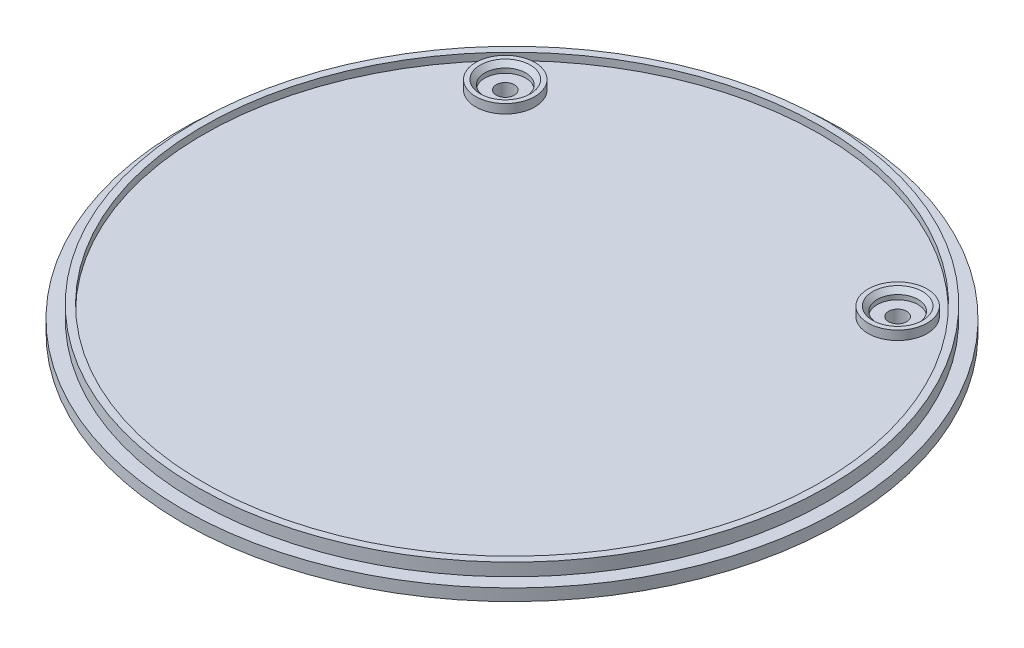
ISO-10303-21;
HEADER;
FILE_DESCRIPTION(('STEP AP214'),'2;1');
FILE_NAME('part.step','',(''),(''),'','','');
FILE_SCHEMA(('AUTOMOTIVE_DESIGN { 1 0 10303 214 1 1 1 1 }'));
ENDSEC;
DATA;
#1=APPLICATION_CONTEXT('core data for automotive mechanical design processes');
#2=APPLICATION_PROTOCOL_DEFINITION('international standard','automotive_design',2000,#1);
#3=PRODUCT_CONTEXT('',#1,'mechanical');
#4=PRODUCT('Part','Part','',(#3));
#5=PRODUCT_RELATED_PRODUCT_CATEGORY('part','',(#4));
#6=PRODUCT_DEFINITION_FORMATION('','',#4);
#7=PRODUCT_DEFINITION_CONTEXT('part definition',#1,'design');
#8=PRODUCT_DEFINITION('design','',#6,#7);
#9=PRODUCT_DEFINITION_SHAPE('','',#8);
#10=(LENGTH_UNIT() NAMED_UNIT(*) SI_UNIT(.MILLI.,.METRE.));
#11=(NAMED_UNIT(*) PLANE_ANGLE_UNIT() SI_UNIT($,.RADIAN.));
#12=(NAMED_UNIT(*) SI_UNIT($,.STERADIAN.) SOLID_ANGLE_UNIT());
#13=UNCERTAINTY_MEASURE_WITH_UNIT(LENGTH_MEASURE(1.E-05),#10,'distance_accuracy_value','');
#14=(GEOMETRIC_REPRESENTATION_CONTEXT(3) GLOBAL_UNCERTAINTY_ASSIGNED_CONTEXT((#13)) GLOBAL_UNIT_ASSIGNED_CONTEXT((#10,
#11,#12)) REPRESENTATION_CONTEXT('',''));
#15=CARTESIAN_POINT('',(0.,0.,0.));
#16=DIRECTION('',(0.,0.,1.));
#17=DIRECTION('',(1.,0.,0.));
#18=AXIS2_PLACEMENT_3D('',#15,#16,#17);
#19=CARTESIAN_POINT('',(0.,0.,0.));
#20=DIRECTION('',(0.,1.,0.));
#21=DIRECTION('',(0.,0.,1.));
#22=AXIS2_PLACEMENT_3D('',#19,#20,#21);
#23=PLANE('',#22);
#24=CARTESIAN_POINT('',(0.,0.,0.));
#25=DIRECTION('',(0.,1.,0.));
#26=DIRECTION('',(0.,0.,1.));
#27=AXIS2_PLACEMENT_3D('',#24,#25,#26);
#28=CIRCLE('',#27,16.5);
#29=CARTESIAN_POINT('',(0.,0.,16.5));
#30=VERTEX_POINT('',#29);
#31=EDGE_CURVE('E128',#30,#30,#28,.T.);
#32=ORIENTED_EDGE('',*,*,#31,.F.);
#33=EDGE_LOOP('',(#32));
#34=FACE_BOUND('',#33,.T.);
#35=ADVANCED_FACE('F16',(#34),#23,.F.);
#36=CARTESIAN_POINT('',(0.,-0.5,0.));
#37=DIRECTION('',(0.,1.,0.));
#38=DIRECTION('',(0.,0.,1.));
#39=AXIS2_PLACEMENT_3D('',#36,#37,#38);
#40=CYLINDRICAL_SURFACE('',#39,16.5);
#41=CARTESIAN_POINT('',(0.,-0.499999999999945,0.));
#42=DIRECTION('',(0.,-1.,0.));
#43=DIRECTION('',(0.,0.,-1.));
#44=AXIS2_PLACEMENT_3D('',#41,#42,#43);
#45=CIRCLE('',#44,16.5);
#46=CARTESIAN_POINT('',(0.,-0.5,-16.5));
#47=VERTEX_POINT('',#46);
#48=EDGE_CURVE('E69',#47,#47,#45,.F.);
#49=ORIENTED_EDGE('',*,*,#48,.F.);
#50=EDGE_LOOP('',(#49));
#51=FACE_BOUND('',#50,.T.);
#52=ORIENTED_EDGE('',*,*,#31,.T.);
#53=EDGE_LOOP('',(#52));
#54=FACE_BOUND('',#53,.T.);
#55=ADVANCED_FACE('F113',(#51,#54),#40,.F.);
#56=CARTESIAN_POINT('',(-2.62510043724167E-10,-0.232455532033882,-34.2582976911812));
#57=CARTESIAN_POINT('',(-2.62510035058757E-10,-0.34207403417429,-34.3998145689233));
#58=CARTESIAN_POINT('',(-2.62510024687541E-10,-0.40000000008312,-34.5691893757008));
#59=CARTESIAN_POINT('',(-2.62510013726569E-10,-0.399999999999999,-34.748195640109));
#60=(BOUNDED_CURVE() B_SPLINE_CURVE(3,(#56,#57,#58,#59),.UNSPECIFIED.,.F.,
.F.) B_SPLINE_CURVE_WITH_KNOTS((4,4),(0.,1.),
.UNSPECIFIED.) CURVE() GEOMETRIC_REPRESENTATION_ITEM() RATIONAL_B_SPLINE_CURVE((1.,
0.964129904654601,0.964129904654601,1.)) REPRESENTATION_ITEM(''));
#61=CARTESIAN_POINT('',(0.,0.4,0.));
#62=DIRECTION('',(0.,-1.,0.));
#63=AXIS1_PLACEMENT('',#61,#62);
#64=SURFACE_OF_REVOLUTION('',#60,#63);
#65=CARTESIAN_POINT('',(0.,-0.232455532012787,0.));
#66=DIRECTION('',(0.,-1.,0.));
#67=DIRECTION('',(0.,0.,-1.));
#68=AXIS2_PLACEMENT_3D('',#65,#66,#67);
#69=CIRCLE('',#68,34.2582976910164);
#70=CARTESIAN_POINT('',(0.,-0.23245553201274,-34.2582976910164));
#71=VERTEX_POINT('',#70);
#72=EDGE_CURVE('E126',#71,#71,#69,.T.);
#73=ORIENTED_EDGE('',*,*,#72,.F.);
#74=EDGE_LOOP('',(#73));
#75=FACE_BOUND('',#74,.T.);
#76=CARTESIAN_POINT('',(0.,-0.399999999999999,0.));
#77=DIRECTION('',(0.,-1.,0.));
#78=DIRECTION('',(-7.55463726655709E-12,0.,-1.));
#79=AXIS2_PLACEMENT_3D('',#76,#77,#78);
#80=CIRCLE('',#79,34.7481956398688);
#81=CARTESIAN_POINT('',(1.57606050175728E-10,-0.4,34.7481956399213));
#82=VERTEX_POINT('',#81);
#83=CARTESIAN_POINT('',(-1.57599980117501E-10,-0.4,-34.7481956399213));
#84=VERTEX_POINT('',#83);
#85=EDGE_CURVE('E58',#82,#84,#80,.F.);
#86=ORIENTED_EDGE('',*,*,#85,.F.);
#87=CARTESIAN_POINT('',(0.,-0.399999999999999,0.));
#88=DIRECTION('',(0.,-1.,0.));
#89=DIRECTION('',(7.55475973123699E-12,0.,1.));
#90=AXIS2_PLACEMENT_3D('',#87,#88,#89);
#91=CIRCLE('',#90,34.7481956398688);
#92=EDGE_CURVE('E56',#84,#82,#91,.F.);
#93=ORIENTED_EDGE('',*,*,#92,.F.);
#94=EDGE_LOOP('',(#86,#93));
#95=FACE_BOUND('',#94,.T.);
#96=ADVANCED_FACE('F60',(#75,#95),#64,.F.);
#97=CARTESIAN_POINT('',(0.,-0.136896424,0.));
#98=DIRECTION('',(0.,-1.,0.));
#99=DIRECTION('',(0.,0.,-1.));
#100=AXIS2_PLACEMENT_3D('',#97,#98,#99);
#101=CONICAL_SURFACE('',#100,34.134931414,0.91173828722413);
#102=ORIENTED_EDGE('',*,*,#72,.T.);
#103=EDGE_LOOP('',(#102));
#104=FACE_BOUND('',#103,.T.);
#105=CARTESIAN_POINT('',(0.,-0.13689642455288,0.));
#106=DIRECTION('',(0.,1.,0.));
#107=DIRECTION('',(-8.24364362223133E-12,0.,1.));
#108=AXIS2_PLACEMENT_3D('',#105,#106,#107);
#109=CIRCLE('',#108,34.1349314138969);
#110=CARTESIAN_POINT('',(-2.81396209645475E-10,-0.13689642455288,34.1349314138969));
#111=VERTEX_POINT('',#110);
#112=EDGE_CURVE('E63',#111,#111,#109,.F.);
#113=ORIENTED_EDGE('',*,*,#112,.F.);
#114=EDGE_LOOP('',(#113));
#115=FACE_BOUND('',#114,.T.);
#116=ADVANCED_FACE('F112',(#104,#115),#101,.F.);
#117=CARTESIAN_POINT('',(0.,-0.5,0.));
#118=DIRECTION('',(0.,-1.,0.));
#119=DIRECTION('',(0.,0.,-1.));
#120=AXIS2_PLACEMENT_3D('',#117,#118,#119);
#121=CONICAL_SURFACE('',#120,16.5,0.785398163397449);
#122=ORIENTED_EDGE('',*,*,#48,.T.);
#123=EDGE_LOOP('',(#122));
#124=FACE_BOUND('',#123,.T.);
#125=CARTESIAN_POINT('',(0.,-1.50000000000006,0.));
#126=DIRECTION('',(0.,-1.,0.));
#127=DIRECTION('',(0.,0.,-1.));
#128=AXIS2_PLACEMENT_3D('',#125,#126,#127);
#129=CIRCLE('',#128,17.5000000000001);
#130=CARTESIAN_POINT('',(0.,-1.50000000000006,-17.5000000000001));
#131=VERTEX_POINT('',#130);
#132=EDGE_CURVE('E103',#131,#131,#129,.F.);
#133=ORIENTED_EDGE('',*,*,#132,.F.);
#134=EDGE_LOOP('',(#133));
#135=FACE_BOUND('',#134,.T.);
#136=ADVANCED_FACE('F90',(#124,#135),#121,.F.);
#137=CARTESIAN_POINT('',(0.,-0.4,0.));
#138=DIRECTION('',(0.,-1.,0.));
#139=DIRECTION('',(0.,0.,-1.));
#140=AXIS2_PLACEMENT_3D('',#137,#138,#139);
#141=PLANE('',#140);
#142=ORIENTED_EDGE('',*,*,#92,.T.);
#143=ORIENTED_EDGE('',*,*,#85,.T.);
#144=EDGE_LOOP('',(#142,#143));
#145=FACE_BOUND('',#144,.T.);
#146=CARTESIAN_POINT('',(0.,-0.4,0.));
#147=DIRECTION('',(0.,-1.,0.));
#148=DIRECTION('',(0.,0.,-1.));
#149=AXIS2_PLACEMENT_3D('',#146,#147,#148);
#150=CIRCLE('',#149,36.25);
#151=CARTESIAN_POINT('',(0.,-0.4,-36.25));
#152=VERTEX_POINT('',#151);
#153=EDGE_CURVE('E191',#152,#152,#150,.F.);
#154=ORIENTED_EDGE('',*,*,#153,.F.);
#155=EDGE_LOOP('',(#154));
#156=FACE_BOUND('',#155,.T.);
#157=ADVANCED_FACE('F67',(#145,#156),#141,.T.);
#158=CARTESIAN_POINT('',(-2.81396209645475E-10,-0.136896424183451,34.13493141342));
#159=CARTESIAN_POINT('',(-2.81396205240197E-10,-0.0811691195176591,34.0629877724534));
#160=CARTESIAN_POINT('',(-2.81396201474938E-10,-0.0140853398216744,34.0014964197073));
#161=CARTESIAN_POINT('',(-2.81396198458006E-10,0.0624252110263096,33.9522261896511));
#162=(BOUNDED_CURVE() B_SPLINE_CURVE(3,(#158,#159,#160,#161),.UNSPECIFIED.,.F.,
.F.) B_SPLINE_CURVE_WITH_KNOTS((4,4),(0.,1.),
.UNSPECIFIED.) CURVE() GEOMETRIC_REPRESENTATION_ITEM() RATIONAL_B_SPLINE_CURVE((1.,
0.990411473101553,0.990411473101553,1.)) REPRESENTATION_ITEM(''));
#163=CARTESIAN_POINT('',(0.,0.495559108,0.));
#164=DIRECTION('',(0.,1.,0.));
#165=AXIS1_PLACEMENT('',#163,#164);
#166=SURFACE_OF_REVOLUTION('',#162,#165);
#167=CARTESIAN_POINT('',(0.,0.0624252110365392,0.));
#168=DIRECTION('',(0.,-1.,0.));
#169=DIRECTION('',(0.,0.,-1.));
#170=AXIS2_PLACEMENT_3D('',#167,#168,#169);
#171=CIRCLE('',#170,33.9522261897974);
#172=CARTESIAN_POINT('',(0.,0.0624252110365391,-33.9522261897974));
#173=VERTEX_POINT('',#172);
#174=EDGE_CURVE('E194',#173,#173,#171,.T.);
#175=ORIENTED_EDGE('',*,*,#174,.F.);
#176=EDGE_LOOP('',(#175));
#177=FACE_BOUND('',#176,.T.);
#178=ORIENTED_EDGE('',*,*,#112,.T.);
#179=EDGE_LOOP('',(#178));
#180=FACE_BOUND('',#179,.T.);
#181=ADVANCED_FACE('F89',(#177,#180),#166,.F.);
#182=CARTESIAN_POINT('',(0.,-1.5,0.));
#183=DIRECTION('',(0.,-1.,0.));
#184=DIRECTION('',(0.,0.,-1.));
#185=AXIS2_PLACEMENT_3D('',#182,#183,#184);
#186=PLANE('',#185);
#187=ORIENTED_EDGE('',*,*,#132,.T.);
#188=EDGE_LOOP('',(#187));
#189=FACE_BOUND('',#188,.T.);
#190=CARTESIAN_POINT('',(0.,-1.5,0.));
#191=DIRECTION('',(0.,1.,0.));
#192=DIRECTION('',(0.,0.,1.));
#193=AXIS2_PLACEMENT_3D('',#190,#191,#192);
#194=CIRCLE('',#193,18.7);
#195=CARTESIAN_POINT('',(0.,-1.5,18.7));
#196=VERTEX_POINT('',#195);
#197=CARTESIAN_POINT('',(0.,-1.5,-18.7));
#198=VERTEX_POINT('',#197);
#199=EDGE_CURVE('E336',#196,#198,#194,.T.);
#200=ORIENTED_EDGE('',*,*,#199,.F.);
#201=CARTESIAN_POINT('',(0.,-1.5,0.));
#202=DIRECTION('',(0.,1.,0.));
#203=DIRECTION('',(0.,0.,-1.));
#204=AXIS2_PLACEMENT_3D('',#201,#202,#203);
#205=CIRCLE('',#204,18.7);
#206=EDGE_CURVE('E190',#198,#196,#205,.T.);
#207=ORIENTED_EDGE('',*,*,#206,.F.);
#208=EDGE_LOOP('',(#200,#207));
#209=FACE_BOUND('',#208,.T.);
#210=ADVANCED_FACE('F342',(#189,#209),#186,.T.);
#211=CARTESIAN_POINT('',(0.,-0.4,0.));
#212=DIRECTION('',(0.,-1.,0.));
#213=DIRECTION('',(0.,0.,-1.));
#214=AXIS2_PLACEMENT_3D('',#211,#212,#213);
#215=CYLINDRICAL_SURFACE('',#214,36.25);
#216=ORIENTED_EDGE('',*,*,#153,.T.);
#217=EDGE_LOOP('',(#216));
#218=FACE_BOUND('',#217,.T.);
#219=CARTESIAN_POINT('',(0.,0.9,0.));
#220=DIRECTION('',(0.,-1.,0.));
#221=DIRECTION('',(0.,0.,-1.));
#222=AXIS2_PLACEMENT_3D('',#219,#220,#221);
#223=CIRCLE('',#222,36.25);
#224=CARTESIAN_POINT('',(0.,0.9,-36.25));
#225=VERTEX_POINT('',#224);
#226=EDGE_CURVE('E186',#225,#225,#223,.F.);
#227=ORIENTED_EDGE('',*,*,#226,.F.);
#228=EDGE_LOOP('',(#227));
#229=FACE_BOUND('',#228,.T.);
#230=ADVANCED_FACE('F350',(#218,#229),#215,.T.);
#231=CARTESIAN_POINT('',(0.,0.2,-33.7));
#232=CARTESIAN_POINT('',(0.,0.2,-33.8042550996858));
#233=CARTESIAN_POINT('',(0.,0.15007809948062,-33.8957806680208));
#234=CARTESIAN_POINT('',(0.,0.0624252109185062,-33.9522261898734));
#235=(BOUNDED_CURVE() B_SPLINE_CURVE(3,(#231,#232,#233,#234),.UNSPECIFIED.,.F.,
.F.) B_SPLINE_CURVE_WITH_KNOTS((4,4),(0.,1.),
.UNSPECIFIED.) CURVE() GEOMETRIC_REPRESENTATION_ITEM() RATIONAL_B_SPLINE_CURVE((1.,
0.91860010436426,0.91860010436426,1.)) REPRESENTATION_ITEM(''));
#236=CARTESIAN_POINT('',(0.,-0.1,0.));
#237=DIRECTION('',(0.,-1.,0.));
#238=AXIS1_PLACEMENT('',#236,#237);
#239=SURFACE_OF_REVOLUTION('',#235,#238);
#240=ORIENTED_EDGE('',*,*,#174,.T.);
#241=EDGE_LOOP('',(#240));
#242=FACE_BOUND('',#241,.T.);
#243=CARTESIAN_POINT('',(0.,0.2,0.));
#244=DIRECTION('',(0.,1.,0.));
#245=DIRECTION('',(0.,0.,-1.));
#246=AXIS2_PLACEMENT_3D('',#243,#244,#245);
#247=CIRCLE('',#246,33.7);
#248=CARTESIAN_POINT('',(0.,0.2,33.7));
#249=VERTEX_POINT('',#248);
#250=CARTESIAN_POINT('',(0.,0.2,-33.7));
#251=VERTEX_POINT('',#250);
#252=EDGE_CURVE('E185',#249,#251,#247,.F.);
#253=ORIENTED_EDGE('',*,*,#252,.F.);
#254=CARTESIAN_POINT('',(0.,0.2,0.));
#255=DIRECTION('',(0.,1.,0.));
#256=DIRECTION('',(0.,0.,1.));
#257=AXIS2_PLACEMENT_3D('',#254,#255,#256);
#258=CIRCLE('',#257,33.7);
#259=EDGE_CURVE('E189',#251,#249,#258,.F.);
#260=ORIENTED_EDGE('',*,*,#259,.F.);
#261=EDGE_LOOP('',(#253,#260));
#262=FACE_BOUND('',#261,.T.);
#263=ADVANCED_FACE('F298',(#242,#262),#239,.F.);
#264=CARTESIAN_POINT('',(0.,-1.5,-18.7));
#265=CARTESIAN_POINT('',(0.,-1.49999999999999,-19.1686291501015));
#266=CARTESIAN_POINT('',(0.,-1.16862915010151,-19.5));
#267=CARTESIAN_POINT('',(0.,-0.699999999999989,-19.5));
#268=(BOUNDED_CURVE() B_SPLINE_CURVE(3,(#264,#265,#266,#267),.UNSPECIFIED.,.F.,
.F.) B_SPLINE_CURVE_WITH_KNOTS((4,4),(0.,1.),
.UNSPECIFIED.) CURVE() GEOMETRIC_REPRESENTATION_ITEM() RATIONAL_B_SPLINE_CURVE((1.,
0.804737854124365,0.804737854124365,1.)) REPRESENTATION_ITEM(''));
#269=CARTESIAN_POINT('',(0.,-0.7,0.));
#270=DIRECTION('',(0.,-1.,0.));
#271=AXIS1_PLACEMENT('',#269,#270);
#272=SURFACE_OF_REVOLUTION('',#268,#271);
#273=CARTESIAN_POINT('',(0.,-0.7,0.));
#274=DIRECTION('',(0.,1.,0.));
#275=DIRECTION('',(0.,0.,1.));
#276=AXIS2_PLACEMENT_3D('',#273,#274,#275);
#277=CIRCLE('',#276,19.5);
#278=CARTESIAN_POINT('',(0.,-0.7,19.5));
#279=VERTEX_POINT('',#278);
#280=EDGE_CURVE('E181',#279,#279,#277,.T.);
#281=ORIENTED_EDGE('',*,*,#280,.F.);
#282=EDGE_LOOP('',(#281));
#283=FACE_BOUND('',#282,.T.);
#284=ORIENTED_EDGE('',*,*,#206,.T.);
#285=ORIENTED_EDGE('',*,*,#199,.T.);
#286=EDGE_LOOP('',(#284,#285));
#287=FACE_BOUND('',#286,.T.);
#288=ADVANCED_FACE('F293',(#283,#287),#272,.F.);
#289=CARTESIAN_POINT('',(0.,0.9,0.));
#290=DIRECTION('',(0.,1.,0.));
#291=DIRECTION('',(0.,0.,1.));
#292=AXIS2_PLACEMENT_3D('',#289,#290,#291);
#293=PLANE('',#292);
#294=CARTESIAN_POINT('',(0.,0.9,0.));
#295=DIRECTION('',(0.,1.,0.));
#296=DIRECTION('',(0.,0.,1.));
#297=AXIS2_PLACEMENT_3D('',#294,#295,#296);
#298=CIRCLE('',#297,34.75);
#299=CARTESIAN_POINT('',(0.,0.9,34.75));
#300=VERTEX_POINT('',#299);
#301=EDGE_CURVE('E178',#300,#300,#298,.T.);
#302=ORIENTED_EDGE('',*,*,#301,.F.);
#303=EDGE_LOOP('',(#302));
#304=FACE_BOUND('',#303,.T.);
#305=ORIENTED_EDGE('',*,*,#226,.T.);
#306=EDGE_LOOP('',(#305));
#307=FACE_BOUND('',#306,.T.);
#308=ADVANCED_FACE('F297',(#304,#307),#293,.T.);
#309=CARTESIAN_POINT('',(-21.58019401,2.,-20.839751114));
#310=DIRECTION('',(0.,-1.,0.));
#311=DIRECTION('',(0.,0.,-1.));
#312=AXIS2_PLACEMENT_3D('',#309,#310,#311);
#313=CYLINDRICAL_SURFACE('',#312,2.25);
#314=CARTESIAN_POINT('',(-21.58019401,1.99999999969003,-20.839751114));
#315=DIRECTION('',(0.,1.,0.));
#316=DIRECTION('',(0.,0.,1.));
#317=AXIS2_PLACEMENT_3D('',#314,#315,#316);
#318=CIRCLE('',#317,2.24999999969007);
#319=CARTESIAN_POINT('',(-21.58019401,1.99999999969007,-18.5897511143099));
#320=VERTEX_POINT('',#319);
#321=EDGE_CURVE('E177',#320,#320,#318,.F.);
#322=ORIENTED_EDGE('',*,*,#321,.F.);
#323=EDGE_LOOP('',(#322));
#324=FACE_BOUND('',#323,.T.);
#325=CARTESIAN_POINT('',(-21.58019401,1.50000000023011,-20.839751114));
#326=DIRECTION('',(0.,-1.,0.));
#327=DIRECTION('',(0.,0.,-1.));
#328=AXIS2_PLACEMENT_3D('',#325,#326,#327);
#329=CIRCLE('',#328,2.25);
#330=CARTESIAN_POINT('',(-21.58019401,1.50000000023011,-23.089751114));
#331=VERTEX_POINT('',#330);
#332=EDGE_CURVE('E182',#331,#331,#329,.F.);
#333=ORIENTED_EDGE('',*,*,#332,.F.);
#334=EDGE_LOOP('',(#333));
#335=FACE_BOUND('',#334,.T.);
#336=ADVANCED_FACE('F264',(#324,#335),#313,.F.);
#337=CARTESIAN_POINT('',(0.,0.2,0.));
#338=DIRECTION('',(0.,-1.,0.));
#339=DIRECTION('',(0.,0.,-1.));
#340=AXIS2_PLACEMENT_3D('',#337,#338,#339);
#341=PLANE('',#340);
#342=CARTESIAN_POINT('',(0.,0.2,0.));
#343=DIRECTION('',(0.,-1.,0.));
#344=DIRECTION('',(0.,0.,-1.));
#345=AXIS2_PLACEMENT_3D('',#342,#343,#344);
#346=CIRCLE('',#345,32.);
#347=CARTESIAN_POINT('',(0.,0.2,-32.));
#348=VERTEX_POINT('',#347);
#349=EDGE_CURVE('E174',#348,#348,#346,.T.);
#350=ORIENTED_EDGE('',*,*,#349,.F.);
#351=EDGE_LOOP('',(#350));
#352=FACE_BOUND('',#351,.T.);
#353=ORIENTED_EDGE('',*,*,#259,.T.);
#354=ORIENTED_EDGE('',*,*,#252,.T.);
#355=EDGE_LOOP('',(#353,#354));
#356=FACE_BOUND('',#355,.T.);
#357=ADVANCED_FACE('F253',(#352,#356),#341,.T.);
#358=CARTESIAN_POINT('',(0.,1.5,0.));
#359=DIRECTION('',(0.,1.,0.));
#360=DIRECTION('',(0.,0.,1.));
#361=AXIS2_PLACEMENT_3D('',#358,#359,#360);
#362=PLANE('',#361);
#363=CARTESIAN_POINT('',(-21.58019401,1.49999999976989,-20.839751114));
#364=DIRECTION('',(0.,1.,0.));
#365=DIRECTION('',(0.,0.,1.));
#366=AXIS2_PLACEMENT_3D('',#363,#364,#365);
#367=CIRCLE('',#366,1.);
#368=CARTESIAN_POINT('',(-21.58019401,1.49999999976989,-19.839751114));
#369=VERTEX_POINT('',#368);
#370=EDGE_CURVE('E171',#369,#369,#367,.T.);
#371=ORIENTED_EDGE('',*,*,#370,.F.);
#372=EDGE_LOOP('',(#371));
#373=FACE_BOUND('',#372,.T.);
#374=ORIENTED_EDGE('',*,*,#332,.T.);
#375=EDGE_LOOP('',(#374));
#376=FACE_BOUND('',#375,.T.);
#377=ADVANCED_FACE('F263',(#373,#376),#362,.T.);
#378=CARTESIAN_POINT('',(0.,-0.3,0.));
#379=DIRECTION('',(0.,1.,0.));
#380=DIRECTION('',(0.,0.,1.));
#381=AXIS2_PLACEMENT_3D('',#378,#379,#380);
#382=CYLINDRICAL_SURFACE('',#381,19.5);
#383=ORIENTED_EDGE('',*,*,#280,.T.);
#384=EDGE_LOOP('',(#383));
#385=FACE_BOUND('',#384,.T.);
#386=CARTESIAN_POINT('',(0.,-0.299999999999996,0.));
#387=DIRECTION('',(0.,1.,0.));
#388=DIRECTION('',(0.,0.,1.));
#389=AXIS2_PLACEMENT_3D('',#386,#387,#388);
#390=CIRCLE('',#389,19.5);
#391=CARTESIAN_POINT('',(0.,-0.299999999999996,19.5));
#392=VERTEX_POINT('',#391);
#393=EDGE_CURVE('E170',#392,#392,#390,.T.);
#394=ORIENTED_EDGE('',*,*,#393,.F.);
#395=EDGE_LOOP('',(#394));
#396=FACE_BOUND('',#395,.T.);
#397=ADVANCED_FACE('F453',(#385,#396),#382,.T.);
#398=CARTESIAN_POINT('',(0.,2.3,0.));
#399=DIRECTION('',(0.,1.,0.));
#400=DIRECTION('',(0.,0.,1.));
#401=AXIS2_PLACEMENT_3D('',#398,#399,#400);
#402=CYLINDRICAL_SURFACE('',#401,34.75);
#403=ORIENTED_EDGE('',*,*,#301,.T.);
#404=EDGE_LOOP('',(#403));
#405=FACE_BOUND('',#404,.T.);
#406=CARTESIAN_POINT('',(0.,2.3,0.));
#407=DIRECTION('',(0.,1.,0.));
#408=DIRECTION('',(0.,0.,1.));
#409=AXIS2_PLACEMENT_3D('',#406,#407,#408);
#410=CIRCLE('',#409,34.75);
#411=CARTESIAN_POINT('',(0.,2.3,34.75));
#412=VERTEX_POINT('',#411);
#413=EDGE_CURVE('E167',#412,#412,#410,.T.);
#414=ORIENTED_EDGE('',*,*,#413,.F.);
#415=EDGE_LOOP('',(#414));
#416=FACE_BOUND('',#415,.T.);
#417=ADVANCED_FACE('F448',(#405,#416),#402,.T.);
#418=CARTESIAN_POINT('',(-21.58019401,2.,-20.839751114));
#419=DIRECTION('',(0.,1.,0.));
#420=DIRECTION('',(0.,0.,1.));
#421=AXIS2_PLACEMENT_3D('',#418,#419,#420);
#422=CONICAL_SURFACE('',#421,2.25000000000001,0.785398163397449);
#423=ORIENTED_EDGE('',*,*,#321,.T.);
#424=EDGE_LOOP('',(#423));
#425=FACE_BOUND('',#424,.T.);
#426=CARTESIAN_POINT('',(-21.58019401,2.50000000015049,-20.839751114));
#427=DIRECTION('',(0.,1.,0.));
#428=DIRECTION('',(0.,0.,1.));
#429=AXIS2_PLACEMENT_3D('',#426,#427,#428);
#430=CIRCLE('',#429,2.7500000001505);
#431=CARTESIAN_POINT('',(-21.58019401,2.50000000015049,-18.0897511138495));
#432=VERTEX_POINT('',#431);
#433=EDGE_CURVE('E164',#432,#432,#430,.F.);
#434=ORIENTED_EDGE('',*,*,#433,.F.);
#435=EDGE_LOOP('',(#434));
#436=FACE_BOUND('',#435,.T.);
#437=ADVANCED_FACE('F441',(#425,#436),#422,.F.);
#438=CARTESIAN_POINT('',(0.,0.,0.));
#439=DIRECTION('',(0.,-1.,0.));
#440=DIRECTION('',(0.,0.,-1.));
#441=AXIS2_PLACEMENT_3D('',#438,#439,#440);
#442=CYLINDRICAL_SURFACE('',#441,32.);
#443=ORIENTED_EDGE('',*,*,#349,.T.);
#444=EDGE_LOOP('',(#443));
#445=FACE_BOUND('',#444,.T.);
#446=CARTESIAN_POINT('',(0.,0.,0.));
#447=DIRECTION('',(0.,-1.,0.));
#448=DIRECTION('',(0.,0.,-1.));
#449=AXIS2_PLACEMENT_3D('',#446,#447,#448);
#450=CIRCLE('',#449,32.);
#451=CARTESIAN_POINT('',(0.,0.,-32.));
#452=VERTEX_POINT('',#451);
#453=EDGE_CURVE('E161',#452,#452,#450,.T.);
#454=ORIENTED_EDGE('',*,*,#453,.F.);
#455=EDGE_LOOP('',(#454));
#456=FACE_BOUND('',#455,.T.);
#457=ADVANCED_FACE('F439',(#445,#456),#442,.T.);
#458=CARTESIAN_POINT('',(-21.58019401,0.,-20.839751114));
#459=DIRECTION('',(0.,1.,0.));
#460=DIRECTION('',(0.,0.,1.));
#461=AXIS2_PLACEMENT_3D('',#458,#459,#460);
#462=CYLINDRICAL_SURFACE('',#461,1.);
#463=ORIENTED_EDGE('',*,*,#370,.T.);
#464=EDGE_LOOP('',(#463));
#465=FACE_BOUND('',#464,.T.);
#466=CARTESIAN_POINT('',(-21.58019401,-2.30105864917896E-10,-20.839751114));
#467=DIRECTION('',(0.,1.,0.));
#468=DIRECTION('',(0.,0.,1.));
#469=AXIS2_PLACEMENT_3D('',#466,#467,#468);
#470=CIRCLE('',#469,1.);
#471=CARTESIAN_POINT('',(-21.58019401,-2.30105864917896E-10,-19.839751114));
#472=VERTEX_POINT('',#471);
#473=EDGE_CURVE('E157',#472,#472,#470,.T.);
#474=ORIENTED_EDGE('',*,*,#473,.F.);
#475=EDGE_LOOP('',(#474));
#476=FACE_BOUND('',#475,.T.);
#477=ADVANCED_FACE('F217',(#465,#476),#462,.F.);
#478=CARTESIAN_POINT('',(0.,0.,19.8));
#479=CARTESIAN_POINT('',(0.,0.,19.6242640687119));
#480=CARTESIAN_POINT('',(0.,-0.124264068711925,19.5));
#481=CARTESIAN_POINT('',(0.,-0.299999999999996,19.5));
#482=(BOUNDED_CURVE() B_SPLINE_CURVE(3,(#478,#479,#480,#481),.UNSPECIFIED.,.F.,
.F.) B_SPLINE_CURVE_WITH_KNOTS((4,4),(0.,1.),
.UNSPECIFIED.) CURVE() GEOMETRIC_REPRESENTATION_ITEM() RATIONAL_B_SPLINE_CURVE((1.,
0.804737854124365,0.804737854124365,1.)) REPRESENTATION_ITEM(''));
#483=CARTESIAN_POINT('',(0.,-0.3,0.));
#484=DIRECTION('',(0.,1.,0.));
#485=AXIS1_PLACEMENT('',#483,#484);
#486=SURFACE_OF_REVOLUTION('',#482,#485);
#487=ORIENTED_EDGE('',*,*,#393,.T.);
#488=EDGE_LOOP('',(#487));
#489=FACE_BOUND('',#488,.T.);
#490=CARTESIAN_POINT('',(0.,0.,0.));
#491=DIRECTION('',(0.,-1.,0.));
#492=DIRECTION('',(0.,0.,1.));
#493=AXIS2_PLACEMENT_3D('',#490,#491,#492);
#494=CIRCLE('',#493,19.8);
#495=CARTESIAN_POINT('',(0.,0.,-19.8));
#496=VERTEX_POINT('',#495);
#497=CARTESIAN_POINT('',(0.,0.,19.8));
#498=VERTEX_POINT('',#497);
#499=EDGE_CURVE('E35',#496,#498,#494,.F.);
#500=ORIENTED_EDGE('',*,*,#499,.F.);
#501=CARTESIAN_POINT('',(0.,0.,0.));
#502=DIRECTION('',(0.,-1.,0.));
#503=DIRECTION('',(0.,0.,-1.));
#504=AXIS2_PLACEMENT_3D('',#501,#502,#503);
#505=CIRCLE('',#504,19.8);
#506=EDGE_CURVE('E160',#498,#496,#505,.F.);
#507=ORIENTED_EDGE('',*,*,#506,.F.);
#508=EDGE_LOOP('',(#500,#507));
#509=FACE_BOUND('',#508,.T.);
#510=ADVANCED_FACE('F205',(#489,#509),#486,.F.);
#511=CARTESIAN_POINT('',(0.,2.3,0.));
#512=DIRECTION('',(0.,1.,0.));
#513=DIRECTION('',(0.,0.,1.));
#514=AXIS2_PLACEMENT_3D('',#511,#512,#513);
#515=PLANE('',#514);
#516=CARTESIAN_POINT('',(0.,2.3,0.));
#517=DIRECTION('',(0.,-1.,0.));
#518=DIRECTION('',(0.,0.,-1.));
#519=AXIS2_PLACEMENT_3D('',#516,#517,#518);
#520=CIRCLE('',#519,33.95);
#521=CARTESIAN_POINT('',(0.,2.3,-33.95));
#522=VERTEX_POINT('',#521);
#523=EDGE_CURVE('E154',#522,#522,#520,.F.);
#524=ORIENTED_EDGE('',*,*,#523,.F.);
#525=EDGE_LOOP('',(#524));
#526=FACE_BOUND('',#525,.T.);
#527=ORIENTED_EDGE('',*,*,#413,.T.);
#528=EDGE_LOOP('',(#527));
#529=FACE_BOUND('',#528,.T.);
#530=ADVANCED_FACE('F216',(#526,#529),#515,.T.);
#531=CARTESIAN_POINT('',(0.,2.5,0.));
#532=DIRECTION('',(0.,1.,0.));
#533=DIRECTION('',(0.,0.,1.));
#534=AXIS2_PLACEMENT_3D('',#531,#532,#533);
#535=PLANE('',#534);
#536=ORIENTED_EDGE('',*,*,#433,.T.);
#537=EDGE_LOOP('',(#536));
#538=FACE_BOUND('',#537,.T.);
#539=CARTESIAN_POINT('',(-21.58019401,2.50000000023011,-20.839751114));
#540=DIRECTION('',(0.,-1.,0.));
#541=DIRECTION('',(0.,0.,-1.));
#542=AXIS2_PLACEMENT_3D('',#539,#540,#541);
#543=CIRCLE('',#542,3.25);
#544=CARTESIAN_POINT('',(-21.58019401,2.50000000023011,-24.089751114));
#545=VERTEX_POINT('',#544);
#546=EDGE_CURVE('E151',#545,#545,#543,.T.);
#547=ORIENTED_EDGE('',*,*,#546,.F.);
#548=EDGE_LOOP('',(#547));
#549=FACE_BOUND('',#548,.T.);
#550=ADVANCED_FACE('F419',(#538,#549),#535,.T.);
#551=CARTESIAN_POINT('',(0.,0.,0.));
#552=DIRECTION('',(0.,1.,0.));
#553=DIRECTION('',(0.,0.,1.));
#554=AXIS2_PLACEMENT_3D('',#551,#552,#553);
#555=PLANE('',#554);
#556=ORIENTED_EDGE('',*,*,#506,.T.);
#557=ORIENTED_EDGE('',*,*,#499,.T.);
#558=EDGE_LOOP('',(#556,#557));
#559=FACE_BOUND('',#558,.T.);
#560=ORIENTED_EDGE('',*,*,#473,.T.);
#561=EDGE_LOOP('',(#560));
#562=FACE_BOUND('',#561,.T.);
#563=CARTESIAN_POINT('',(21.58019401,-2.30105864917896E-10,-20.839751114));
#564=DIRECTION('',(0.,1.,0.));
#565=DIRECTION('',(0.,0.,1.));
#566=AXIS2_PLACEMENT_3D('',#563,#564,#565);
#567=CIRCLE('',#566,1.);
#568=CARTESIAN_POINT('',(21.58019401,-2.30105864917896E-10,-19.839751114));
#569=VERTEX_POINT('',#568);
#570=EDGE_CURVE('E148',#569,#569,#567,.F.);
#571=ORIENTED_EDGE('',*,*,#570,.F.);
#572=EDGE_LOOP('',(#571));
#573=FACE_BOUND('',#572,.T.);
#574=ORIENTED_EDGE('',*,*,#453,.T.);
#575=EDGE_LOOP('',(#574));
#576=FACE_BOUND('',#575,.T.);
#577=ADVANCED_FACE('F415',(#559,#562,#573,#576),#555,.F.);
#578=CARTESIAN_POINT('',(0.,2.3,0.));
#579=DIRECTION('',(0.,-1.,0.));
#580=DIRECTION('',(0.,0.,-1.));
#581=AXIS2_PLACEMENT_3D('',#578,#579,#580);
#582=CYLINDRICAL_SURFACE('',#581,33.95);
#583=CARTESIAN_POINT('',(0.,1.5,0.));
#584=DIRECTION('',(0.,-1.,0.));
#585=DIRECTION('',(0.,0.,-1.));
#586=AXIS2_PLACEMENT_3D('',#583,#584,#585);
#587=CIRCLE('',#586,33.95);
#588=CARTESIAN_POINT('',(0.,1.5,-33.95));
#589=VERTEX_POINT('',#588);
#590=EDGE_CURVE('E145',#589,#589,#587,.F.);
#591=ORIENTED_EDGE('',*,*,#590,.F.);
#592=EDGE_LOOP('',(#591));
#593=FACE_BOUND('',#592,.T.);
#594=ORIENTED_EDGE('',*,*,#523,.T.);
#595=EDGE_LOOP('',(#594));
#596=FACE_BOUND('',#595,.T.);
#597=ADVANCED_FACE('F412',(#593,#596),#582,.F.);
#598=CARTESIAN_POINT('',(-21.58019401,1.5,-20.839751114));
#599=DIRECTION('',(0.,-1.,0.));
#600=DIRECTION('',(0.,0.,-1.));
#601=AXIS2_PLACEMENT_3D('',#598,#599,#600);
#602=CYLINDRICAL_SURFACE('',#601,3.25);
#603=CARTESIAN_POINT('',(-21.58019401,1.49999999976989,-20.839751114));
#604=DIRECTION('',(0.,-1.,0.));
#605=DIRECTION('',(0.,0.,-1.));
#606=AXIS2_PLACEMENT_3D('',#603,#604,#605);
#607=CIRCLE('',#606,3.25);
#608=CARTESIAN_POINT('',(-21.58019401,1.49999999976989,-24.089751114));
#609=VERTEX_POINT('',#608);
#610=EDGE_CURVE('E142',#609,#609,#607,.T.);
#611=ORIENTED_EDGE('',*,*,#610,.F.);
#612=EDGE_LOOP('',(#611));
#613=FACE_BOUND('',#612,.T.);
#614=ORIENTED_EDGE('',*,*,#546,.T.);
#615=EDGE_LOOP('',(#614));
#616=FACE_BOUND('',#615,.T.);
#617=ADVANCED_FACE('F408',(#613,#616),#602,.T.);
#618=CARTESIAN_POINT('',(21.58019401,0.,-20.839751114));
#619=DIRECTION('',(0.,1.,0.));
#620=DIRECTION('',(0.,0.,1.));
#621=AXIS2_PLACEMENT_3D('',#618,#619,#620);
#622=CYLINDRICAL_SURFACE('',#621,1.);
#623=CARTESIAN_POINT('',(21.58019401,1.49999999976989,-20.839751114));
#624=DIRECTION('',(0.,1.,0.));
#625=DIRECTION('',(0.,0.,1.));
#626=AXIS2_PLACEMENT_3D('',#623,#624,#625);
#627=CIRCLE('',#626,1.);
#628=CARTESIAN_POINT('',(21.58019401,1.49999999976989,-19.839751114));
#629=VERTEX_POINT('',#628);
#630=EDGE_CURVE('E139',#629,#629,#627,.F.);
#631=ORIENTED_EDGE('',*,*,#630,.F.);
#632=EDGE_LOOP('',(#631));
#633=FACE_BOUND('',#632,.T.);
#634=ORIENTED_EDGE('',*,*,#570,.T.);
#635=EDGE_LOOP('',(#634));
#636=FACE_BOUND('',#635,.T.);
#637=ADVANCED_FACE('F404',(#633,#636),#622,.F.);
#638=CARTESIAN_POINT('',(0.,1.5,0.));
#639=DIRECTION('',(0.,1.,0.));
#640=DIRECTION('',(0.,0.,1.));
#641=AXIS2_PLACEMENT_3D('',#638,#639,#640);
#642=PLANE('',#641);
#643=ORIENTED_EDGE('',*,*,#610,.T.);
#644=EDGE_LOOP('',(#643));
#645=FACE_BOUND('',#644,.T.);
#646=CARTESIAN_POINT('',(21.58019401,1.49999999976989,-20.839751114));
#647=DIRECTION('',(0.,-1.,0.));
#648=DIRECTION('',(0.,0.,-1.));
#649=AXIS2_PLACEMENT_3D('',#646,#647,#648);
#650=CIRCLE('',#649,3.25);
#651=CARTESIAN_POINT('',(21.58019401,1.49999999976989,-24.089751114));
#652=VERTEX_POINT('',#651);
#653=EDGE_CURVE('E136',#652,#652,#650,.F.);
#654=ORIENTED_EDGE('',*,*,#653,.F.);
#655=EDGE_LOOP('',(#654));
#656=FACE_BOUND('',#655,.T.);
#657=ORIENTED_EDGE('',*,*,#590,.T.);
#658=EDGE_LOOP('',(#657));
#659=FACE_BOUND('',#658,.T.);
#660=ADVANCED_FACE('F400',(#645,#656,#659),#642,.T.);
#661=CARTESIAN_POINT('',(0.,1.5,0.));
#662=DIRECTION('',(0.,1.,0.));
#663=DIRECTION('',(0.,0.,1.));
#664=AXIS2_PLACEMENT_3D('',#661,#662,#663);
#665=PLANE('',#664);
#666=ORIENTED_EDGE('',*,*,#630,.T.);
#667=EDGE_LOOP('',(#666));
#668=FACE_BOUND('',#667,.T.);
#669=CARTESIAN_POINT('',(21.58019401,1.50000000023011,-20.839751114));
#670=DIRECTION('',(0.,-1.,0.));
#671=DIRECTION('',(0.,0.,-1.));
#672=AXIS2_PLACEMENT_3D('',#669,#670,#671);
#673=CIRCLE('',#672,2.25);
#674=CARTESIAN_POINT('',(21.58019401,1.50000000023011,-23.089751114));
#675=VERTEX_POINT('',#674);
#676=EDGE_CURVE('E133',#675,#675,#673,.T.);
#677=ORIENTED_EDGE('',*,*,#676,.F.);
#678=EDGE_LOOP('',(#677));
#679=FACE_BOUND('',#678,.T.);
#680=ADVANCED_FACE('F396',(#668,#679),#665,.T.);
#681=CARTESIAN_POINT('',(21.58019401,1.5,-20.839751114));
#682=DIRECTION('',(0.,-1.,0.));
#683=DIRECTION('',(0.,0.,-1.));
#684=AXIS2_PLACEMENT_3D('',#681,#682,#683);
#685=CYLINDRICAL_SURFACE('',#684,3.25);
#686=ORIENTED_EDGE('',*,*,#653,.T.);
#687=EDGE_LOOP('',(#686));
#688=FACE_BOUND('',#687,.T.);
#689=CARTESIAN_POINT('',(21.58019401,2.49999999976989,-20.839751114));
#690=DIRECTION('',(0.,-1.,0.));
#691=DIRECTION('',(0.,0.,-1.));
#692=AXIS2_PLACEMENT_3D('',#689,#690,#691);
#693=CIRCLE('',#692,3.25);
#694=CARTESIAN_POINT('',(21.58019401,2.49999999976989,-24.089751114));
#695=VERTEX_POINT('',#694);
#696=EDGE_CURVE('E130',#695,#695,#693,.F.);
#697=ORIENTED_EDGE('',*,*,#696,.F.);
#698=EDGE_LOOP('',(#697));
#699=FACE_BOUND('',#698,.T.);
#700=ADVANCED_FACE('F392',(#688,#699),#685,.T.);
#701=CARTESIAN_POINT('',(21.58019401,2.,-20.839751114));
#702=DIRECTION('',(0.,-1.,0.));
#703=DIRECTION('',(0.,0.,-1.));
#704=AXIS2_PLACEMENT_3D('',#701,#702,#703);
#705=CYLINDRICAL_SURFACE('',#704,2.25);
#706=CARTESIAN_POINT('',(21.58019401,2.00000000007972,-20.839751114));
#707=DIRECTION('',(0.,1.,0.));
#708=DIRECTION('',(0.,0.,1.));
#709=AXIS2_PLACEMENT_3D('',#706,#707,#708);
#710=CIRCLE('',#709,2.25000000007978);
#711=CARTESIAN_POINT('',(21.58019401,2.00000000007978,-18.5897511139202));
#712=VERTEX_POINT('',#711);
#713=EDGE_CURVE('E27',#712,#712,#710,.F.);
#714=ORIENTED_EDGE('',*,*,#713,.F.);
#715=EDGE_LOOP('',(#714));
#716=FACE_BOUND('',#715,.T.);
#717=ORIENTED_EDGE('',*,*,#676,.T.);
#718=EDGE_LOOP('',(#717));
#719=FACE_BOUND('',#718,.T.);
#720=ADVANCED_FACE('F384',(#716,#719),#705,.F.);
#721=CARTESIAN_POINT('',(0.,2.5,0.));
#722=DIRECTION('',(0.,1.,0.));
#723=DIRECTION('',(0.,0.,1.));
#724=AXIS2_PLACEMENT_3D('',#721,#722,#723);
#725=PLANE('',#724);
#726=CARTESIAN_POINT('',(21.58019401,2.50000000007988,-20.839751114));
#727=DIRECTION('',(0.,1.,0.));
#728=DIRECTION('',(0.,0.,1.));
#729=AXIS2_PLACEMENT_3D('',#726,#727,#728);
#730=CIRCLE('',#729,2.75000000007989);
#731=CARTESIAN_POINT('',(21.58019401,2.50000000007988,-18.0897511139201));
#732=VERTEX_POINT('',#731);
#733=EDGE_CURVE('E11',#732,#732,#730,.T.);
#734=ORIENTED_EDGE('',*,*,#733,.F.);
#735=EDGE_LOOP('',(#734));
#736=FACE_BOUND('',#735,.T.);
#737=ORIENTED_EDGE('',*,*,#696,.T.);
#738=EDGE_LOOP('',(#737));
#739=FACE_BOUND('',#738,.T.);
#740=ADVANCED_FACE('F378',(#736,#739),#725,.T.);
#741=CARTESIAN_POINT('',(21.58019401,2.,-20.839751114));
#742=DIRECTION('',(0.,1.,0.));
#743=DIRECTION('',(0.,0.,1.));
#744=AXIS2_PLACEMENT_3D('',#741,#742,#743);
#745=CONICAL_SURFACE('',#744,2.25000000000001,0.785398163397449);
#746=ORIENTED_EDGE('',*,*,#713,.T.);
#747=EDGE_LOOP('',(#746));
#748=FACE_BOUND('',#747,.T.);
#749=ORIENTED_EDGE('',*,*,#733,.T.);
#750=EDGE_LOOP('',(#749));
#751=FACE_BOUND('',#750,.T.);
#752=ADVANCED_FACE('F376',(#748,#751),#745,.F.);
#753=CLOSED_SHELL('',(#35,#55,#96,#116,#136,#157,#181,#210,#230,#263,#288,#308,#336,#357,#377,
#397,#417,#437,#457,#477,#510,#530,#550,#577,#597,#617,#637,#660,#680,#700,#720,#740,#752));
#754=MANIFOLD_SOLID_BREP('B1',#753);
#755=ADVANCED_BREP_SHAPE_REPRESENTATION('',(#18,#754),#14);
#756=SHAPE_DEFINITION_REPRESENTATION(#9,#755);
ENDSEC;
END-ISO-10303-21;
